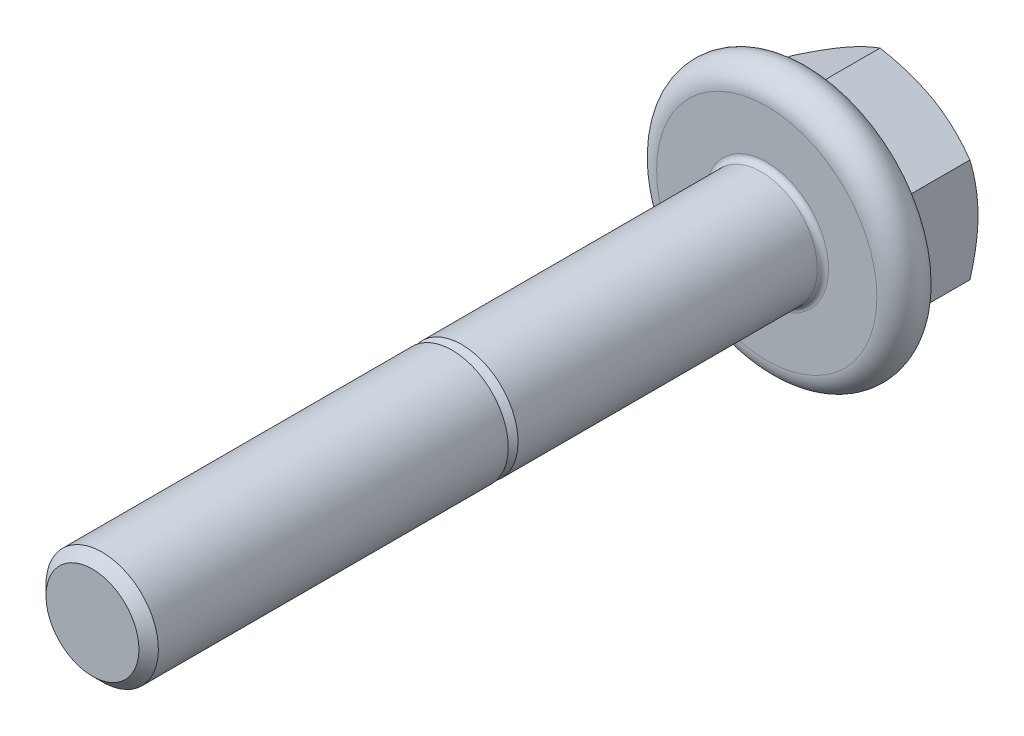
ISO-10303-21;
HEADER;
FILE_DESCRIPTION(('STEP AP214'),'2;1');
FILE_NAME('part.step','',(''),(''),'','','');
FILE_SCHEMA(('AUTOMOTIVE_DESIGN { 1 0 10303 214 1 1 1 1 }'));
ENDSEC;
DATA;
#1=APPLICATION_CONTEXT('core data for automotive mechanical design processes');
#2=APPLICATION_PROTOCOL_DEFINITION('international standard','automotive_design',2000,#1);
#3=PRODUCT_CONTEXT('',#1,'mechanical');
#4=PRODUCT('Part','Part','',(#3));
#5=PRODUCT_RELATED_PRODUCT_CATEGORY('part','',(#4));
#6=PRODUCT_DEFINITION_FORMATION('','',#4);
#7=PRODUCT_DEFINITION_CONTEXT('part definition',#1,'design');
#8=PRODUCT_DEFINITION('design','',#6,#7);
#9=PRODUCT_DEFINITION_SHAPE('','',#8);
#10=(LENGTH_UNIT() NAMED_UNIT(*) SI_UNIT(.MILLI.,.METRE.));
#11=(NAMED_UNIT(*) PLANE_ANGLE_UNIT() SI_UNIT($,.RADIAN.));
#12=(NAMED_UNIT(*) SI_UNIT($,.STERADIAN.) SOLID_ANGLE_UNIT());
#13=UNCERTAINTY_MEASURE_WITH_UNIT(LENGTH_MEASURE(1.E-05),#10,'distance_accuracy_value','');
#14=(GEOMETRIC_REPRESENTATION_CONTEXT(3) GLOBAL_UNCERTAINTY_ASSIGNED_CONTEXT((#13)) GLOBAL_UNIT_ASSIGNED_CONTEXT((#10,
#11,#12)) REPRESENTATION_CONTEXT('',''));
#15=CARTESIAN_POINT('',(0.,0.,0.));
#16=DIRECTION('',(0.,0.,1.));
#17=DIRECTION('',(1.,0.,0.));
#18=AXIS2_PLACEMENT_3D('',#15,#16,#17);
#19=CARTESIAN_POINT('',(0.,1.0335,30.));
#20=DIRECTION('',(0.,0.,1.));
#21=DIRECTION('',(0.,1.,0.));
#22=AXIS2_PLACEMENT_3D('',#19,#20,#21);
#23=PLANE('',#22);
#24=CARTESIAN_POINT('',(0.,0.,30.));
#25=DIRECTION('',(0.,0.,1.));
#26=DIRECTION('',(0.,1.,0.));
#27=AXIS2_PLACEMENT_3D('',#24,#25,#26);
#28=CIRCLE('',#27,2.067);
#29=CARTESIAN_POINT('',(0.,2.067,30.));
#30=VERTEX_POINT('',#29);
#31=EDGE_CURVE('E12',#30,#30,#28,.T.);
#32=ORIENTED_EDGE('',*,*,#31,.T.);
#33=EDGE_LOOP('',(#32));
#34=FACE_BOUND('',#33,.T.);
#35=ADVANCED_FACE('F21',(#34),#23,.T.);
#36=CARTESIAN_POINT('',(0.,0.,29.7835));
#37=DIRECTION('',(0.,0.,-1.));
#38=DIRECTION('',(0.,1.,0.));
#39=AXIS2_PLACEMENT_3D('',#36,#37,#38);
#40=CONICAL_SURFACE('',#39,2.2835,0.785398163397448);
#41=CARTESIAN_POINT('',(0.,0.,29.567));
#42=DIRECTION('',(0.,0.,1.));
#43=DIRECTION('',(0.,1.,0.));
#44=AXIS2_PLACEMENT_3D('',#41,#42,#43);
#45=CIRCLE('',#44,2.5);
#46=CARTESIAN_POINT('',(0.,2.5,29.567));
#47=VERTEX_POINT('',#46);
#48=EDGE_CURVE('E32',#47,#47,#45,.T.);
#49=ORIENTED_EDGE('',*,*,#48,.T.);
#50=EDGE_LOOP('',(#49));
#51=FACE_BOUND('',#50,.T.);
#52=ORIENTED_EDGE('',*,*,#31,.F.);
#53=EDGE_LOOP('',(#52));
#54=FACE_BOUND('',#53,.T.);
#55=ADVANCED_FACE('F416',(#51,#54),#40,.T.);
#56=CARTESIAN_POINT('',(0.,0.,21.7835));
#57=DIRECTION('',(0.,0.,-1.));
#58=DIRECTION('',(0.,1.,0.));
#59=AXIS2_PLACEMENT_3D('',#56,#57,#58);
#60=CYLINDRICAL_SURFACE('',#59,2.5);
#61=CARTESIAN_POINT('',(0.,0.,14.));
#62=DIRECTION('',(0.,0.,1.));
#63=DIRECTION('',(0.,1.,0.));
#64=AXIS2_PLACEMENT_3D('',#61,#62,#63);
#65=CIRCLE('',#64,2.5);
#66=CARTESIAN_POINT('',(0.,2.5,14.));
#67=VERTEX_POINT('',#66);
#68=EDGE_CURVE('E265',#67,#67,#65,.T.);
#69=ORIENTED_EDGE('',*,*,#68,.T.);
#70=EDGE_LOOP('',(#69));
#71=FACE_BOUND('',#70,.T.);
#72=ORIENTED_EDGE('',*,*,#48,.F.);
#73=EDGE_LOOP('',(#72));
#74=FACE_BOUND('',#73,.T.);
#75=ADVANCED_FACE('F421',(#71,#74),#60,.T.);
#76=CARTESIAN_POINT('',(0.,2.2835,14.));
#77=DIRECTION('',(0.,0.,-1.));
#78=DIRECTION('',(0.,-1.,0.));
#79=AXIS2_PLACEMENT_3D('',#76,#77,#78);
#80=PLANE('',#79);
#81=CARTESIAN_POINT('',(0.,0.,14.));
#82=DIRECTION('',(0.,0.,1.));
#83=DIRECTION('',(0.,1.,0.));
#84=AXIS2_PLACEMENT_3D('',#81,#82,#83);
#85=CIRCLE('',#84,2.067);
#86=CARTESIAN_POINT('',(0.,2.067,14.));
#87=VERTEX_POINT('',#86);
#88=EDGE_CURVE('E165',#87,#87,#85,.T.);
#89=ORIENTED_EDGE('',*,*,#88,.T.);
#90=EDGE_LOOP('',(#89));
#91=FACE_BOUND('',#90,.T.);
#92=ORIENTED_EDGE('',*,*,#68,.F.);
#93=EDGE_LOOP('',(#92));
#94=FACE_BOUND('',#93,.T.);
#95=ADVANCED_FACE('F459',(#91,#94),#80,.T.);
#96=CARTESIAN_POINT('',(0.,0.,13.7835));
#97=DIRECTION('',(0.,0.,-1.));
#98=DIRECTION('',(0.,1.,0.));
#99=AXIS2_PLACEMENT_3D('',#96,#97,#98);
#100=CONICAL_SURFACE('',#99,2.2835,0.785398163397448);
#101=CARTESIAN_POINT('',(0.,0.,13.567));
#102=DIRECTION('',(0.,0.,1.));
#103=DIRECTION('',(0.,1.,0.));
#104=AXIS2_PLACEMENT_3D('',#101,#102,#103);
#105=CIRCLE('',#104,2.5);
#106=CARTESIAN_POINT('',(0.,2.5,13.567));
#107=VERTEX_POINT('',#106);
#108=EDGE_CURVE('E283',#107,#107,#105,.T.);
#109=ORIENTED_EDGE('',*,*,#108,.T.);
#110=EDGE_LOOP('',(#109));
#111=FACE_BOUND('',#110,.T.);
#112=ORIENTED_EDGE('',*,*,#88,.F.);
#113=EDGE_LOOP('',(#112));
#114=FACE_BOUND('',#113,.T.);
#115=ADVANCED_FACE('F425',(#111,#114),#100,.T.);
#116=CARTESIAN_POINT('',(0.,0.,6.9085));
#117=DIRECTION('',(0.,0.,-1.));
#118=DIRECTION('',(0.,1.,0.));
#119=AXIS2_PLACEMENT_3D('',#116,#117,#118);
#120=CYLINDRICAL_SURFACE('',#119,2.5);
#121=CARTESIAN_POINT('',(0.,0.,0.25));
#122=DIRECTION('',(0.,0.,1.));
#123=DIRECTION('',(0.,1.,0.));
#124=AXIS2_PLACEMENT_3D('',#121,#122,#123);
#125=CIRCLE('',#124,2.5);
#126=CARTESIAN_POINT('',(0.,2.5,0.25));
#127=VERTEX_POINT('',#126);
#128=EDGE_CURVE('E287',#127,#127,#125,.T.);
#129=ORIENTED_EDGE('',*,*,#128,.T.);
#130=EDGE_LOOP('',(#129));
#131=FACE_BOUND('',#130,.T.);
#132=ORIENTED_EDGE('',*,*,#108,.F.);
#133=EDGE_LOOP('',(#132));
#134=FACE_BOUND('',#133,.T.);
#135=ADVANCED_FACE('F454',(#131,#134),#120,.T.);
#136=CARTESIAN_POINT('',(0.,0.,0.25));
#137=DIRECTION('',(0.,0.,1.));
#138=DIRECTION('',(1.,0.,0.));
#139=AXIS2_PLACEMENT_3D('',#136,#137,#138);
#140=TOROIDAL_SURFACE('',#139,2.75,0.25);
#141=CARTESIAN_POINT('',(0.,0.,0.));
#142=DIRECTION('',(0.,0.,1.));
#143=DIRECTION('',(0.,1.,0.));
#144=AXIS2_PLACEMENT_3D('',#141,#142,#143);
#145=CIRCLE('',#144,2.75);
#146=CARTESIAN_POINT('',(0.,2.75,0.));
#147=VERTEX_POINT('',#146);
#148=EDGE_CURVE('E282',#147,#147,#145,.T.);
#149=ORIENTED_EDGE('',*,*,#148,.T.);
#150=EDGE_LOOP('',(#149));
#151=FACE_BOUND('',#150,.T.);
#152=ORIENTED_EDGE('',*,*,#128,.F.);
#153=EDGE_LOOP('',(#152));
#154=FACE_BOUND('',#153,.T.);
#155=ADVANCED_FACE('F450',(#151,#154),#140,.F.);
#156=CARTESIAN_POINT('',(0.,3.825,0.));
#157=DIRECTION('',(0.,0.,1.));
#158=DIRECTION('',(0.,1.,0.));
#159=AXIS2_PLACEMENT_3D('',#156,#157,#158);
#160=PLANE('',#159);
#161=CARTESIAN_POINT('',(0.,0.,0.));
#162=DIRECTION('',(0.,0.,1.));
#163=DIRECTION('',(0.,1.,0.));
#164=AXIS2_PLACEMENT_3D('',#161,#162,#163);
#165=CIRCLE('',#164,4.9);
#166=CARTESIAN_POINT('',(0.,4.9,0.));
#167=VERTEX_POINT('',#166);
#168=EDGE_CURVE('E277',#167,#167,#165,.T.);
#169=ORIENTED_EDGE('',*,*,#168,.T.);
#170=EDGE_LOOP('',(#169));
#171=FACE_BOUND('',#170,.T.);
#172=ORIENTED_EDGE('',*,*,#148,.F.);
#173=EDGE_LOOP('',(#172));
#174=FACE_BOUND('',#173,.T.);
#175=ADVANCED_FACE('F453',(#171,#174),#160,.T.);
#176=CARTESIAN_POINT('',(0.,0.,-1.));
#177=DIRECTION('',(0.,0.,1.));
#178=DIRECTION('',(1.,0.,0.));
#179=AXIS2_PLACEMENT_3D('',#176,#177,#178);
#180=TOROIDAL_SURFACE('',#179,4.9,1.);
#181=CARTESIAN_POINT('',(0.,0.,-1.96592582628907));
#182=DIRECTION('',(0.,0.,1.));
#183=DIRECTION('',(0.,1.,0.));
#184=AXIS2_PLACEMENT_3D('',#181,#182,#183);
#185=CIRCLE('',#184,5.15881904510252);
#186=CARTESIAN_POINT('',(0.,5.15881904510252,-1.96592582628907));
#187=VERTEX_POINT('',#186);
#188=EDGE_CURVE('E209',#187,#187,#185,.T.);
#189=ORIENTED_EDGE('',*,*,#188,.T.);
#190=EDGE_LOOP('',(#189));
#191=FACE_BOUND('',#190,.T.);
#192=ORIENTED_EDGE('',*,*,#168,.F.);
#193=EDGE_LOOP('',(#192));
#194=FACE_BOUND('',#193,.T.);
#195=ADVANCED_FACE('F447',(#191,#194),#180,.T.);
#196=CARTESIAN_POINT('',(0.,0.,-2.65707652480583));
#197=DIRECTION('',(0.,0.,1.));
#198=DIRECTION('',(0.,1.,0.));
#199=AXIS2_PLACEMENT_3D('',#196,#197,#198);
#200=CONICAL_SURFACE('',#199,2.57940952255126,1.30899693899575);
#201=ORIENTED_EDGE('',*,*,#188,.F.);
#202=EDGE_LOOP('',(#201));
#203=FACE_BOUND('',#202,.T.);
#204=CARTESIAN_POINT('',(-0.82135790978107,-5.09301336383014,-1.96592582628907));
#205=CARTESIAN_POINT('',(2.,-3.46410161513775,-2.51718681631936));
#206=CARTESIAN_POINT('',(4.82135790978107,-1.83518986644537,-1.96592582628907));
#207=(BOUNDED_CURVE() B_SPLINE_CURVE(2,(#204,#205,#206),.UNSPECIFIED.,.F.,
.F.) B_SPLINE_CURVE_WITH_KNOTS((3,3),(0.,6.54517442508375),
.UNSPECIFIED.) CURVE() GEOMETRIC_REPRESENTATION_ITEM() RATIONAL_B_SPLINE_CURVE((1.,
1.28970476127563,1.)) REPRESENTATION_ITEM(''));
#208=CARTESIAN_POINT('',(0.,-4.61880215351701,-2.11062291628857));
#209=VERTEX_POINT('',#208);
#210=CARTESIAN_POINT('',(4.,-2.3094010767585,-2.11062291628857));
#211=VERTEX_POINT('',#210);
#212=EDGE_CURVE('E183',#209,#211,#207,.T.);
#213=ORIENTED_EDGE('',*,*,#212,.T.);
#214=CARTESIAN_POINT('',(4.,-3.25782349738476,-1.96592582628907));
#215=CARTESIAN_POINT('',(3.99999999999999,0.,-2.51718681631936));
#216=CARTESIAN_POINT('',(4.,3.25782349738477,-1.96592582628907));
#217=(BOUNDED_CURVE() B_SPLINE_CURVE(2,(#214,#215,#216),.UNSPECIFIED.,.F.,
.F.) B_SPLINE_CURVE_WITH_KNOTS((3,3),(0.,6.54517442508375),
.UNSPECIFIED.) CURVE() GEOMETRIC_REPRESENTATION_ITEM() RATIONAL_B_SPLINE_CURVE((1.,
1.28970476127563,1.)) REPRESENTATION_ITEM(''));
#218=CARTESIAN_POINT('',(4.,2.30940107675851,-2.11062291628857));
#219=VERTEX_POINT('',#218);
#220=EDGE_CURVE('E238',#211,#219,#217,.T.);
#221=ORIENTED_EDGE('',*,*,#220,.T.);
#222=CARTESIAN_POINT('',(4.82135790978107,1.83518986644538,-1.96592582628907));
#223=CARTESIAN_POINT('',(2.,3.46410161513776,-2.51718681631936));
#224=CARTESIAN_POINT('',(-0.821357909781073,5.09301336383014,-1.96592582628907));
#225=(BOUNDED_CURVE() B_SPLINE_CURVE(2,(#222,#223,#224),.UNSPECIFIED.,.F.,
.F.) B_SPLINE_CURVE_WITH_KNOTS((3,3),(0.,6.54517442508375),
.UNSPECIFIED.) CURVE() GEOMETRIC_REPRESENTATION_ITEM() RATIONAL_B_SPLINE_CURVE((1.,
1.28970476127562,1.)) REPRESENTATION_ITEM(''));
#226=CARTESIAN_POINT('',(0.,4.61880215351701,-2.11062291628857));
#227=VERTEX_POINT('',#226);
#228=EDGE_CURVE('E159',#219,#227,#225,.T.);
#229=ORIENTED_EDGE('',*,*,#228,.T.);
#230=CARTESIAN_POINT('',(0.821357909781071,5.09301336383014,-1.96592582628907));
#231=CARTESIAN_POINT('',(-2.,3.46410161513775,-2.51718681631936));
#232=CARTESIAN_POINT('',(-4.82135790978107,1.83518986644537,-1.96592582628907));
#233=(BOUNDED_CURVE() B_SPLINE_CURVE(2,(#230,#231,#232),.UNSPECIFIED.,.F.,
.F.) B_SPLINE_CURVE_WITH_KNOTS((3,3),(0.,6.54517442508376),
.UNSPECIFIED.) CURVE() GEOMETRIC_REPRESENTATION_ITEM() RATIONAL_B_SPLINE_CURVE((1.,
1.28970476127563,1.)) REPRESENTATION_ITEM(''));
#234=CARTESIAN_POINT('',(-4.,2.3094010767585,-2.11062291628857));
#235=VERTEX_POINT('',#234);
#236=EDGE_CURVE('E301',#227,#235,#233,.T.);
#237=ORIENTED_EDGE('',*,*,#236,.T.);
#238=CARTESIAN_POINT('',(-4.,3.25782349738476,-1.96592582628907));
#239=CARTESIAN_POINT('',(-4.00000000000001,0.,-2.51718681631936));
#240=CARTESIAN_POINT('',(-4.,-3.25782349738476,-1.96592582628907));
#241=(BOUNDED_CURVE() B_SPLINE_CURVE(2,(#238,#239,#240),.UNSPECIFIED.,.F.,
.F.) B_SPLINE_CURVE_WITH_KNOTS((3,3),(0.,6.54517442508375),
.UNSPECIFIED.) CURVE() GEOMETRIC_REPRESENTATION_ITEM() RATIONAL_B_SPLINE_CURVE((1.,
1.28970476127563,1.)) REPRESENTATION_ITEM(''));
#242=CARTESIAN_POINT('',(-4.,-2.30940107675851,-2.11062291628857));
#243=VERTEX_POINT('',#242);
#244=EDGE_CURVE('E226',#235,#243,#241,.T.);
#245=ORIENTED_EDGE('',*,*,#244,.T.);
#246=CARTESIAN_POINT('',(-4.82135790978107,-1.83518986644538,-1.96592582628907));
#247=CARTESIAN_POINT('',(-2.,-3.46410161513775,-2.51718681631936));
#248=CARTESIAN_POINT('',(0.821357909781071,-5.09301336383014,-1.96592582628907));
#249=(BOUNDED_CURVE() B_SPLINE_CURVE(2,(#246,#247,#248),.UNSPECIFIED.,.F.,
.F.) B_SPLINE_CURVE_WITH_KNOTS((3,3),(0.,6.54517442508375),
.UNSPECIFIED.) CURVE() GEOMETRIC_REPRESENTATION_ITEM() RATIONAL_B_SPLINE_CURVE((1.,
1.28970476127563,1.)) REPRESENTATION_ITEM(''));
#250=EDGE_CURVE('E201',#243,#209,#249,.T.);
#251=ORIENTED_EDGE('',*,*,#250,.T.);
#252=EDGE_LOOP('',(#213,#221,#229,#237,#245,#251));
#253=FACE_BOUND('',#252,.T.);
#254=ADVANCED_FACE('F356',(#203,#253),#200,.T.);
#255=CARTESIAN_POINT('',(-2.,-3.46410161513775,1.));
#256=DIRECTION('',(-0.5,-0.866025403784439,0.));
#257=DIRECTION('',(-0.866025403784439,0.5,0.));
#258=AXIS2_PLACEMENT_3D('',#255,#256,#257);
#259=PLANE('',#258);
#260=ORIENTED_EDGE('',*,*,#250,.F.);
#261=DIRECTION('',(0.,0.,-1.));
#262=VECTOR('',#261,1.);
#263=CARTESIAN_POINT('',(-4.,-2.30940107675851,1.));
#264=LINE('',#263,#262);
#265=CARTESIAN_POINT('',(-4.,-2.30940107675851,-5.04273441009184));
#266=VERTEX_POINT('',#265);
#267=EDGE_CURVE('E210',#243,#266,#264,.T.);
#268=ORIENTED_EDGE('',*,*,#267,.T.);
#269=CARTESIAN_POINT('',(0.00207392470908036,-4.61999953450607,-5.04204283310243));
#270=CARTESIAN_POINT('',(-1.07096337600506,-4.00048116008825,-5.4));
#271=CARTESIAN_POINT('',(-2.,-3.46410161513775,-5.4));
#272=CARTESIAN_POINT('',(-2.92903662399494,-2.92772207018726,-5.4));
#273=CARTESIAN_POINT('',(-4.00207392470908,-2.30820369576943,-5.04204283310243));
#274=(BOUNDED_CURVE() B_SPLINE_CURVE(2,(#269,#270,#271,#272,#273),.UNSPECIFIED.,.F.,
.F.) B_SPLINE_CURVE_WITH_KNOTS((3,2,3),(0.,2.34532655900568,4.69065311801137),
.UNSPECIFIED.) CURVE() GEOMETRIC_REPRESENTATION_ITEM() RATIONAL_B_SPLINE_CURVE((1.,
1.03802697460135,1.,1.03802697460133,1.)) REPRESENTATION_ITEM(''));
#275=CARTESIAN_POINT('',(-2.,-3.46410161513775,-5.4));
#276=VERTEX_POINT('',#275);
#277=EDGE_CURVE('E333',#276,#266,#274,.T.);
#278=ORIENTED_EDGE('',*,*,#277,.F.);
#279=CARTESIAN_POINT('',(0.00207392470908036,-4.61999953450607,-5.04204283310243));
#280=CARTESIAN_POINT('',(-1.07096337600506,-4.00048116008825,-5.4));
#281=CARTESIAN_POINT('',(-2.,-3.46410161513775,-5.4));
#282=CARTESIAN_POINT('',(-2.92903662399494,-2.92772207018726,-5.4));
#283=CARTESIAN_POINT('',(-4.00207392470908,-2.30820369576943,-5.04204283310243));
#284=(BOUNDED_CURVE() B_SPLINE_CURVE(2,(#279,#280,#281,#282,#283),.UNSPECIFIED.,.F.,
.F.) B_SPLINE_CURVE_WITH_KNOTS((3,2,3),(0.,2.34532655900568,4.69065311801137),
.UNSPECIFIED.) CURVE() GEOMETRIC_REPRESENTATION_ITEM() RATIONAL_B_SPLINE_CURVE((1.,
1.03802697460135,1.,1.03802697460133,1.)) REPRESENTATION_ITEM(''));
#285=CARTESIAN_POINT('',(0.,-4.61880215351701,-5.04273441009184));
#286=VERTEX_POINT('',#285);
#287=EDGE_CURVE('E366',#286,#276,#284,.T.);
#288=ORIENTED_EDGE('',*,*,#287,.F.);
#289=DIRECTION('',(0.,0.,-1.));
#290=VECTOR('',#289,1.);
#291=CARTESIAN_POINT('',(0.,-4.61880215351701,1.));
#292=LINE('',#291,#290);
#293=EDGE_CURVE('E25',#209,#286,#292,.T.);
#294=ORIENTED_EDGE('',*,*,#293,.F.);
#295=EDGE_LOOP('',(#260,#268,#278,#288,#294));
#296=FACE_BOUND('',#295,.T.);
#297=ADVANCED_FACE('F363',(#296),#259,.T.);
#298=CARTESIAN_POINT('',(-4.,0.,1.));
#299=DIRECTION('',(-1.,0.,0.));
#300=DIRECTION('',(0.,1.,0.));
#301=AXIS2_PLACEMENT_3D('',#298,#299,#300);
#302=PLANE('',#301);
#303=ORIENTED_EDGE('',*,*,#244,.F.);
#304=DIRECTION('',(0.,0.,-1.));
#305=VECTOR('',#304,1.);
#306=CARTESIAN_POINT('',(-4.,2.3094010767585,1.));
#307=LINE('',#306,#305);
#308=CARTESIAN_POINT('',(-4.,2.3094010767585,-5.04273441009184));
#309=VERTEX_POINT('',#308);
#310=EDGE_CURVE('E233',#235,#309,#307,.T.);
#311=ORIENTED_EDGE('',*,*,#310,.T.);
#312=CARTESIAN_POINT('',(-4.,-2.31179583873663,-5.04204283310243));
#313=CARTESIAN_POINT('',(-4.,-1.07275908990099,-5.4));
#314=CARTESIAN_POINT('',(-4.,0.,-5.4));
#315=CARTESIAN_POINT('',(-4.,1.07275908990099,-5.4));
#316=CARTESIAN_POINT('',(-4.,2.31179583873663,-5.04204283310243));
#317=(BOUNDED_CURVE() B_SPLINE_CURVE(2,(#312,#313,#314,#315,#316),.UNSPECIFIED.,.F.,
.F.) B_SPLINE_CURVE_WITH_KNOTS((3,2,3),(0.,2.34532655900568,4.69065311801137),
.UNSPECIFIED.) CURVE() GEOMETRIC_REPRESENTATION_ITEM() RATIONAL_B_SPLINE_CURVE((1.,
1.03802697460135,1.,1.03802697460135,1.)) REPRESENTATION_ITEM(''));
#318=CARTESIAN_POINT('',(-4.,0.,-5.4));
#319=VERTEX_POINT('',#318);
#320=EDGE_CURVE('E139',#319,#309,#317,.T.);
#321=ORIENTED_EDGE('',*,*,#320,.F.);
#322=CARTESIAN_POINT('',(-4.,-2.31179583873663,-5.04204283310243));
#323=CARTESIAN_POINT('',(-4.,-1.07275908990099,-5.4));
#324=CARTESIAN_POINT('',(-4.,0.,-5.4));
#325=CARTESIAN_POINT('',(-4.,1.07275908990099,-5.4));
#326=CARTESIAN_POINT('',(-4.,2.31179583873663,-5.04204283310243));
#327=(BOUNDED_CURVE() B_SPLINE_CURVE(2,(#322,#323,#324,#325,#326),.UNSPECIFIED.,.F.,
.F.) B_SPLINE_CURVE_WITH_KNOTS((3,2,3),(0.,2.34532655900568,4.69065311801137),
.UNSPECIFIED.) CURVE() GEOMETRIC_REPRESENTATION_ITEM() RATIONAL_B_SPLINE_CURVE((1.,
1.03802697460135,1.,1.03802697460135,1.)) REPRESENTATION_ITEM(''));
#328=EDGE_CURVE('E198',#266,#319,#327,.T.);
#329=ORIENTED_EDGE('',*,*,#328,.F.);
#330=ORIENTED_EDGE('',*,*,#267,.F.);
#331=EDGE_LOOP('',(#303,#311,#321,#329,#330));
#332=FACE_BOUND('',#331,.T.);
#333=ADVANCED_FACE('F400',(#332),#302,.T.);
#334=CARTESIAN_POINT('',(-2.,3.46410161513775,1.));
#335=DIRECTION('',(-0.5,0.866025403784439,0.));
#336=DIRECTION('',(0.866025403784439,0.5,0.));
#337=AXIS2_PLACEMENT_3D('',#334,#335,#336);
#338=PLANE('',#337);
#339=ORIENTED_EDGE('',*,*,#236,.F.);
#340=DIRECTION('',(0.,0.,-1.));
#341=VECTOR('',#340,1.);
#342=CARTESIAN_POINT('',(0.,4.61880215351701,1.));
#343=LINE('',#342,#341);
#344=CARTESIAN_POINT('',(0.,4.61880215351701,-5.04273441009184));
#345=VERTEX_POINT('',#344);
#346=EDGE_CURVE('E149',#227,#345,#343,.T.);
#347=ORIENTED_EDGE('',*,*,#346,.T.);
#348=CARTESIAN_POINT('',(-4.00207392470907,2.30820369576943,-5.04204283310243));
#349=CARTESIAN_POINT('',(-2.92903662399494,2.92772207018726,-5.40000000000001));
#350=CARTESIAN_POINT('',(-2.,3.46410161513775,-5.4));
#351=CARTESIAN_POINT('',(-1.07096337600507,4.00048116008825,-5.4));
#352=CARTESIAN_POINT('',(0.00207392470907583,4.61999953450607,-5.04204283310243));
#353=(BOUNDED_CURVE() B_SPLINE_CURVE(2,(#348,#349,#350,#351,#352),.UNSPECIFIED.,.F.,
.F.) B_SPLINE_CURVE_WITH_KNOTS((3,2,3),(0.,2.34532655900568,4.69065311801136),
.UNSPECIFIED.) CURVE() GEOMETRIC_REPRESENTATION_ITEM() RATIONAL_B_SPLINE_CURVE((1.,
1.03802697460135,1.,1.03802697460135,1.)) REPRESENTATION_ITEM(''));
#354=CARTESIAN_POINT('',(-2.,3.46410161513775,-5.4));
#355=VERTEX_POINT('',#354);
#356=EDGE_CURVE('E126',#355,#345,#353,.T.);
#357=ORIENTED_EDGE('',*,*,#356,.F.);
#358=CARTESIAN_POINT('',(-4.00207392470907,2.30820369576943,-5.04204283310243));
#359=CARTESIAN_POINT('',(-2.92903662399494,2.92772207018726,-5.40000000000001));
#360=CARTESIAN_POINT('',(-2.,3.46410161513775,-5.4));
#361=CARTESIAN_POINT('',(-1.07096337600507,4.00048116008825,-5.4));
#362=CARTESIAN_POINT('',(0.00207392470907583,4.61999953450607,-5.04204283310243));
#363=(BOUNDED_CURVE() B_SPLINE_CURVE(2,(#358,#359,#360,#361,#362),.UNSPECIFIED.,.F.,
.F.) B_SPLINE_CURVE_WITH_KNOTS((3,2,3),(0.,2.34532655900568,4.69065311801136),
.UNSPECIFIED.) CURVE() GEOMETRIC_REPRESENTATION_ITEM() RATIONAL_B_SPLINE_CURVE((1.,
1.03802697460135,1.,1.03802697460135,1.)) REPRESENTATION_ITEM(''));
#364=EDGE_CURVE('E302',#309,#355,#363,.T.);
#365=ORIENTED_EDGE('',*,*,#364,.F.);
#366=ORIENTED_EDGE('',*,*,#310,.F.);
#367=EDGE_LOOP('',(#339,#347,#357,#365,#366));
#368=FACE_BOUND('',#367,.T.);
#369=ADVANCED_FACE('F430',(#368),#338,.T.);
#370=CARTESIAN_POINT('',(0.,-2.,-5.4));
#371=DIRECTION('',(0.,0.,-1.));
#372=DIRECTION('',(0.,-1.,0.));
#373=AXIS2_PLACEMENT_3D('',#370,#371,#372);
#374=PLANE('',#373);
#375=CARTESIAN_POINT('',(0.,0.,-5.4));
#376=DIRECTION('',(0.,0.,-1.));
#377=DIRECTION('',(0.,-1.,0.));
#378=AXIS2_PLACEMENT_3D('',#375,#376,#377);
#379=CIRCLE('',#378,4.);
#380=CARTESIAN_POINT('',(2.,-3.46410161513775,-5.4));
#381=VERTEX_POINT('',#380);
#382=EDGE_CURVE('E339',#381,#276,#379,.T.);
#383=ORIENTED_EDGE('',*,*,#382,.T.);
#384=CARTESIAN_POINT('',(0.,0.,-5.4));
#385=DIRECTION('',(0.,0.,-1.));
#386=DIRECTION('',(0.,-1.,0.));
#387=AXIS2_PLACEMENT_3D('',#384,#385,#386);
#388=CIRCLE('',#387,4.);
#389=EDGE_CURVE('E379',#276,#319,#388,.T.);
#390=ORIENTED_EDGE('',*,*,#389,.T.);
#391=CARTESIAN_POINT('',(0.,0.,-5.4));
#392=DIRECTION('',(0.,0.,-1.));
#393=DIRECTION('',(0.,-1.,0.));
#394=AXIS2_PLACEMENT_3D('',#391,#392,#393);
#395=CIRCLE('',#394,4.);
#396=EDGE_CURVE('E135',#319,#355,#395,.T.);
#397=ORIENTED_EDGE('',*,*,#396,.T.);
#398=CARTESIAN_POINT('',(0.,0.,-5.4));
#399=DIRECTION('',(0.,0.,-1.));
#400=DIRECTION('',(0.,-1.,0.));
#401=AXIS2_PLACEMENT_3D('',#398,#399,#400);
#402=CIRCLE('',#401,4.);
#403=CARTESIAN_POINT('',(2.,3.46410161513775,-5.4));
#404=VERTEX_POINT('',#403);
#405=EDGE_CURVE('E130',#355,#404,#402,.T.);
#406=ORIENTED_EDGE('',*,*,#405,.T.);
#407=CARTESIAN_POINT('',(0.,0.,-5.4));
#408=DIRECTION('',(0.,0.,-1.));
#409=DIRECTION('',(0.,-1.,0.));
#410=AXIS2_PLACEMENT_3D('',#407,#408,#409);
#411=CIRCLE('',#410,4.);
#412=CARTESIAN_POINT('',(4.,0.,-5.4));
#413=VERTEX_POINT('',#412);
#414=EDGE_CURVE('E115',#404,#413,#411,.T.);
#415=ORIENTED_EDGE('',*,*,#414,.T.);
#416=CARTESIAN_POINT('',(0.,0.,-5.4));
#417=DIRECTION('',(0.,0.,-1.));
#418=DIRECTION('',(0.,-1.,0.));
#419=AXIS2_PLACEMENT_3D('',#416,#417,#418);
#420=CIRCLE('',#419,4.);
#421=EDGE_CURVE('E125',#413,#381,#420,.T.);
#422=ORIENTED_EDGE('',*,*,#421,.T.);
#423=EDGE_LOOP('',(#383,#390,#397,#406,#415,#422));
#424=FACE_BOUND('',#423,.T.);
#425=ADVANCED_FACE('F133',(#424),#374,.T.);
#426=CARTESIAN_POINT('',(0.,0.,-5.22102141655122));
#427=DIRECTION('',(0.,0.,1.));
#428=DIRECTION('',(0.,-1.,0.));
#429=AXIS2_PLACEMENT_3D('',#426,#427,#428);
#430=CONICAL_SURFACE('',#429,4.31,1.0471975511966);
#431=ORIENTED_EDGE('',*,*,#277,.T.);
#432=ORIENTED_EDGE('',*,*,#328,.T.);
#433=ORIENTED_EDGE('',*,*,#389,.F.);
#434=EDGE_LOOP('',(#431,#432,#433));
#435=FACE_BOUND('',#434,.T.);
#436=ADVANCED_FACE('F398',(#435),#430,.T.);
#437=CARTESIAN_POINT('',(0.,0.,-5.22102141655122));
#438=DIRECTION('',(0.,0.,1.));
#439=DIRECTION('',(0.,-1.,0.));
#440=AXIS2_PLACEMENT_3D('',#437,#438,#439);
#441=CONICAL_SURFACE('',#440,4.31,1.0471975511966);
#442=CARTESIAN_POINT('',(4.00207392470908,-2.30820369576943,-5.04204283310243));
#443=CARTESIAN_POINT('',(2.92903662399493,-2.92772207018726,-5.4));
#444=CARTESIAN_POINT('',(2.,-3.46410161513775,-5.4));
#445=CARTESIAN_POINT('',(1.07096337600507,-4.00048116008825,-5.4));
#446=CARTESIAN_POINT('',(-0.00207392470907593,-4.61999953450607,-5.04204283310243));
#447=(BOUNDED_CURVE() B_SPLINE_CURVE(2,(#442,#443,#444,#445,#446),.UNSPECIFIED.,.F.,
.F.) B_SPLINE_CURVE_WITH_KNOTS((3,2,3),(0.,2.34532655900568,4.69065311801136),
.UNSPECIFIED.) CURVE() GEOMETRIC_REPRESENTATION_ITEM() RATIONAL_B_SPLINE_CURVE((1.,
1.03802697460135,1.,1.03802697460135,1.)) REPRESENTATION_ITEM(''));
#448=EDGE_CURVE('E316',#381,#286,#447,.T.);
#449=ORIENTED_EDGE('',*,*,#448,.T.);
#450=ORIENTED_EDGE('',*,*,#287,.T.);
#451=ORIENTED_EDGE('',*,*,#382,.F.);
#452=EDGE_LOOP('',(#449,#450,#451));
#453=FACE_BOUND('',#452,.T.);
#454=ADVANCED_FACE('F427',(#453),#441,.T.);
#455=CARTESIAN_POINT('',(0.,0.,-5.22102141655122));
#456=DIRECTION('',(0.,0.,1.));
#457=DIRECTION('',(0.,-1.,0.));
#458=AXIS2_PLACEMENT_3D('',#455,#456,#457);
#459=CONICAL_SURFACE('',#458,4.31,1.0471975511966);
#460=CARTESIAN_POINT('',(4.,2.31179583873663,-5.04204283310243));
#461=CARTESIAN_POINT('',(4.,1.07275908990099,-5.4));
#462=CARTESIAN_POINT('',(4.,0.,-5.4));
#463=CARTESIAN_POINT('',(3.99999999999999,-1.07275908990099,-5.39999999999999));
#464=CARTESIAN_POINT('',(4.,-2.31179583873663,-5.04204283310243));
#465=(BOUNDED_CURVE() B_SPLINE_CURVE(2,(#460,#461,#462,#463,#464),.UNSPECIFIED.,.F.,
.F.) B_SPLINE_CURVE_WITH_KNOTS((3,2,3),(0.,2.34532655900568,4.69065311801137),
.UNSPECIFIED.) CURVE() GEOMETRIC_REPRESENTATION_ITEM() RATIONAL_B_SPLINE_CURVE((1.,
1.03802697460134,1.,1.03802697460135,1.)) REPRESENTATION_ITEM(''));
#466=CARTESIAN_POINT('',(4.,-2.3094010767585,-5.04273441009184));
#467=VERTEX_POINT('',#466);
#468=EDGE_CURVE('E184',#413,#467,#465,.T.);
#469=ORIENTED_EDGE('',*,*,#468,.T.);
#470=CARTESIAN_POINT('',(4.00207392470908,-2.30820369576943,-5.04204283310243));
#471=CARTESIAN_POINT('',(2.92903662399493,-2.92772207018726,-5.4));
#472=CARTESIAN_POINT('',(2.,-3.46410161513775,-5.4));
#473=CARTESIAN_POINT('',(1.07096337600507,-4.00048116008825,-5.4));
#474=CARTESIAN_POINT('',(-0.00207392470907593,-4.61999953450607,-5.04204283310243));
#475=(BOUNDED_CURVE() B_SPLINE_CURVE(2,(#470,#471,#472,#473,#474),.UNSPECIFIED.,.F.,
.F.) B_SPLINE_CURVE_WITH_KNOTS((3,2,3),(0.,2.34532655900568,4.69065311801136),
.UNSPECIFIED.) CURVE() GEOMETRIC_REPRESENTATION_ITEM() RATIONAL_B_SPLINE_CURVE((1.,
1.03802697460135,1.,1.03802697460135,1.)) REPRESENTATION_ITEM(''));
#476=EDGE_CURVE('E211',#467,#381,#475,.T.);
#477=ORIENTED_EDGE('',*,*,#476,.T.);
#478=ORIENTED_EDGE('',*,*,#421,.F.);
#479=EDGE_LOOP('',(#469,#477,#478));
#480=FACE_BOUND('',#479,.T.);
#481=ADVANCED_FACE('F352',(#480),#459,.T.);
#482=CARTESIAN_POINT('',(0.,0.,-5.22102141655122));
#483=DIRECTION('',(0.,0.,1.));
#484=DIRECTION('',(0.,-1.,0.));
#485=AXIS2_PLACEMENT_3D('',#482,#483,#484);
#486=CONICAL_SURFACE('',#485,4.31,1.0471975511966);
#487=CARTESIAN_POINT('',(4.,2.31179583873663,-5.04204283310243));
#488=CARTESIAN_POINT('',(4.,1.07275908990099,-5.4));
#489=CARTESIAN_POINT('',(4.,0.,-5.4));
#490=CARTESIAN_POINT('',(3.99999999999999,-1.07275908990099,-5.39999999999999));
#491=CARTESIAN_POINT('',(4.,-2.31179583873663,-5.04204283310243));
#492=(BOUNDED_CURVE() B_SPLINE_CURVE(2,(#487,#488,#489,#490,#491),.UNSPECIFIED.,.F.,
.F.) B_SPLINE_CURVE_WITH_KNOTS((3,2,3),(0.,2.34532655900568,4.69065311801137),
.UNSPECIFIED.) CURVE() GEOMETRIC_REPRESENTATION_ITEM() RATIONAL_B_SPLINE_CURVE((1.,
1.03802697460134,1.,1.03802697460135,1.)) REPRESENTATION_ITEM(''));
#493=CARTESIAN_POINT('',(4.,2.30940107675851,-5.04273441009184));
#494=VERTEX_POINT('',#493);
#495=EDGE_CURVE('E120',#494,#413,#492,.T.);
#496=ORIENTED_EDGE('',*,*,#495,.T.);
#497=ORIENTED_EDGE('',*,*,#414,.F.);
#498=CARTESIAN_POINT('',(-0.00207392470907593,4.61999953450607,-5.04204283310243));
#499=CARTESIAN_POINT('',(1.07096337600507,4.00048116008826,-5.40000000000001));
#500=CARTESIAN_POINT('',(2.,3.46410161513775,-5.4));
#501=CARTESIAN_POINT('',(2.92903662399493,2.92772207018727,-5.4));
#502=CARTESIAN_POINT('',(4.00207392470907,2.30820369576944,-5.04204283310243));
#503=(BOUNDED_CURVE() B_SPLINE_CURVE(2,(#498,#499,#500,#501,#502),.UNSPECIFIED.,.F.,
.F.) B_SPLINE_CURVE_WITH_KNOTS((3,2,3),(0.,2.34532655900568,4.69065311801136),
.UNSPECIFIED.) CURVE() GEOMETRIC_REPRESENTATION_ITEM() RATIONAL_B_SPLINE_CURVE((1.,
1.03802697460133,1.,1.03802697460134,1.)) REPRESENTATION_ITEM(''));
#504=EDGE_CURVE('E118',#404,#494,#503,.T.);
#505=ORIENTED_EDGE('',*,*,#504,.T.);
#506=EDGE_LOOP('',(#496,#497,#505));
#507=FACE_BOUND('',#506,.T.);
#508=ADVANCED_FACE('F23',(#507),#486,.T.);
#509=CARTESIAN_POINT('',(0.,0.,-5.22102141655122));
#510=DIRECTION('',(0.,0.,1.));
#511=DIRECTION('',(0.,-1.,0.));
#512=AXIS2_PLACEMENT_3D('',#509,#510,#511);
#513=CONICAL_SURFACE('',#512,4.31,1.0471975511966);
#514=CARTESIAN_POINT('',(-0.00207392470907593,4.61999953450607,-5.04204283310243));
#515=CARTESIAN_POINT('',(1.07096337600507,4.00048116008826,-5.40000000000001));
#516=CARTESIAN_POINT('',(2.,3.46410161513775,-5.4));
#517=CARTESIAN_POINT('',(2.92903662399493,2.92772207018727,-5.4));
#518=CARTESIAN_POINT('',(4.00207392470907,2.30820369576944,-5.04204283310243));
#519=(BOUNDED_CURVE() B_SPLINE_CURVE(2,(#514,#515,#516,#517,#518),.UNSPECIFIED.,.F.,
.F.) B_SPLINE_CURVE_WITH_KNOTS((3,2,3),(0.,2.34532655900568,4.69065311801136),
.UNSPECIFIED.) CURVE() GEOMETRIC_REPRESENTATION_ITEM() RATIONAL_B_SPLINE_CURVE((1.,
1.03802697460133,1.,1.03802697460134,1.)) REPRESENTATION_ITEM(''));
#520=EDGE_CURVE('E142',#345,#404,#519,.T.);
#521=ORIENTED_EDGE('',*,*,#520,.T.);
#522=ORIENTED_EDGE('',*,*,#405,.F.);
#523=ORIENTED_EDGE('',*,*,#356,.T.);
#524=EDGE_LOOP('',(#521,#522,#523));
#525=FACE_BOUND('',#524,.T.);
#526=ADVANCED_FACE('F143',(#525),#513,.T.);
#527=CARTESIAN_POINT('',(0.,0.,-5.22102141655122));
#528=DIRECTION('',(0.,0.,1.));
#529=DIRECTION('',(0.,-1.,0.));
#530=AXIS2_PLACEMENT_3D('',#527,#528,#529);
#531=CONICAL_SURFACE('',#530,4.31,1.0471975511966);
#532=ORIENTED_EDGE('',*,*,#364,.T.);
#533=ORIENTED_EDGE('',*,*,#396,.F.);
#534=ORIENTED_EDGE('',*,*,#320,.T.);
#535=EDGE_LOOP('',(#532,#533,#534));
#536=FACE_BOUND('',#535,.T.);
#537=ADVANCED_FACE('F403',(#536),#531,.T.);
#538=CARTESIAN_POINT('',(2.,-3.46410161513775,1.));
#539=DIRECTION('',(0.5,-0.866025403784439,0.));
#540=DIRECTION('',(-0.866025403784439,-0.5,0.));
#541=AXIS2_PLACEMENT_3D('',#538,#539,#540);
#542=PLANE('',#541);
#543=ORIENTED_EDGE('',*,*,#212,.F.);
#544=ORIENTED_EDGE('',*,*,#293,.T.);
#545=ORIENTED_EDGE('',*,*,#448,.F.);
#546=ORIENTED_EDGE('',*,*,#476,.F.);
#547=DIRECTION('',(0.,0.,-1.));
#548=VECTOR('',#547,1.);
#549=CARTESIAN_POINT('',(4.,-2.30940107675851,1.));
#550=LINE('',#549,#548);
#551=EDGE_CURVE('E247',#211,#467,#550,.T.);
#552=ORIENTED_EDGE('',*,*,#551,.F.);
#553=EDGE_LOOP('',(#543,#544,#545,#546,#552));
#554=FACE_BOUND('',#553,.T.);
#555=ADVANCED_FACE('F361',(#554),#542,.T.);
#556=CARTESIAN_POINT('',(4.,0.,1.));
#557=DIRECTION('',(1.,0.,0.));
#558=DIRECTION('',(0.,-1.,0.));
#559=AXIS2_PLACEMENT_3D('',#556,#557,#558);
#560=PLANE('',#559);
#561=ORIENTED_EDGE('',*,*,#220,.F.);
#562=ORIENTED_EDGE('',*,*,#551,.T.);
#563=ORIENTED_EDGE('',*,*,#468,.F.);
#564=ORIENTED_EDGE('',*,*,#495,.F.);
#565=DIRECTION('',(0.,0.,-1.));
#566=VECTOR('',#565,1.);
#567=CARTESIAN_POINT('',(4.,2.30940107675851,1.));
#568=LINE('',#567,#566);
#569=EDGE_CURVE('E154',#219,#494,#568,.T.);
#570=ORIENTED_EDGE('',*,*,#569,.F.);
#571=EDGE_LOOP('',(#561,#562,#563,#564,#570));
#572=FACE_BOUND('',#571,.T.);
#573=ADVANCED_FACE('F353',(#572),#560,.T.);
#574=CARTESIAN_POINT('',(2.,3.46410161513775,1.));
#575=DIRECTION('',(0.5,0.866025403784439,0.));
#576=DIRECTION('',(0.866025403784439,-0.5,0.));
#577=AXIS2_PLACEMENT_3D('',#574,#575,#576);
#578=PLANE('',#577);
#579=ORIENTED_EDGE('',*,*,#228,.F.);
#580=ORIENTED_EDGE('',*,*,#569,.T.);
#581=ORIENTED_EDGE('',*,*,#504,.F.);
#582=ORIENTED_EDGE('',*,*,#520,.F.);
#583=ORIENTED_EDGE('',*,*,#346,.F.);
#584=EDGE_LOOP('',(#579,#580,#581,#582,#583));
#585=FACE_BOUND('',#584,.T.);
#586=ADVANCED_FACE('F152',(#585),#578,.T.);
#587=CLOSED_SHELL('',(#35,#55,#75,#95,#115,#135,#155,#175,#195,#254,#297,#333,#369,#425,#436,
#454,#481,#508,#526,#537,#555,#573,#586));
#588=MANIFOLD_SOLID_BREP('B1',#587);
#589=ADVANCED_BREP_SHAPE_REPRESENTATION('',(#18,#588),#14);
#590=SHAPE_DEFINITION_REPRESENTATION(#9,#589);
ENDSEC;
END-ISO-10303-21;
